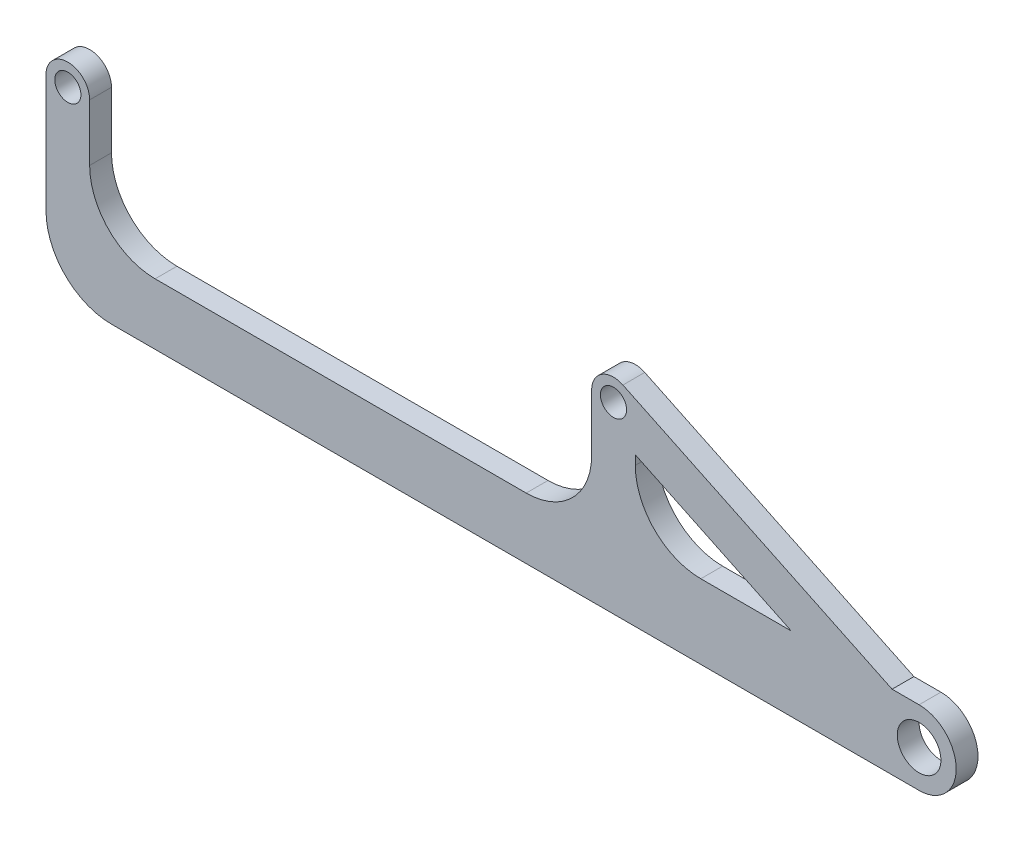
ISO-10303-21;
HEADER;
FILE_DESCRIPTION(('STEP AP214'),'2;1');
FILE_NAME('part.step','',(''),(''),'','','');
FILE_SCHEMA(('AUTOMOTIVE_DESIGN { 1 0 10303 214 1 1 1 1 }'));
ENDSEC;
DATA;
#1=APPLICATION_CONTEXT('core data for automotive mechanical design processes');
#2=APPLICATION_PROTOCOL_DEFINITION('international standard','automotive_design',2000,#1);
#3=PRODUCT_CONTEXT('',#1,'mechanical');
#4=PRODUCT('Part','Part','',(#3));
#5=PRODUCT_RELATED_PRODUCT_CATEGORY('part','',(#4));
#6=PRODUCT_DEFINITION_FORMATION('','',#4);
#7=PRODUCT_DEFINITION_CONTEXT('part definition',#1,'design');
#8=PRODUCT_DEFINITION('design','',#6,#7);
#9=PRODUCT_DEFINITION_SHAPE('','',#8);
#10=(LENGTH_UNIT() NAMED_UNIT(*) SI_UNIT(.MILLI.,.METRE.));
#11=(NAMED_UNIT(*) PLANE_ANGLE_UNIT() SI_UNIT($,.RADIAN.));
#12=(NAMED_UNIT(*) SI_UNIT($,.STERADIAN.) SOLID_ANGLE_UNIT());
#13=UNCERTAINTY_MEASURE_WITH_UNIT(LENGTH_MEASURE(1.E-05),#10,'distance_accuracy_value','');
#14=(GEOMETRIC_REPRESENTATION_CONTEXT(3) GLOBAL_UNCERTAINTY_ASSIGNED_CONTEXT((#13)) GLOBAL_UNIT_ASSIGNED_CONTEXT((#10,
#11,#12)) REPRESENTATION_CONTEXT('',''));
#15=CARTESIAN_POINT('',(0.,0.,0.));
#16=DIRECTION('',(0.,0.,1.));
#17=DIRECTION('',(1.,0.,0.));
#18=AXIS2_PLACEMENT_3D('',#15,#16,#17);
#19=CARTESIAN_POINT('',(184.164810690423,-64.4576837416478,5.));
#20=DIRECTION('',(-0.943858356366018,0.330350424728104,0.));
#21=DIRECTION('',(-0.330350424728104,-0.943858356366018,0.));
#22=AXIS2_PLACEMENT_3D('',#19,#20,#21);
#23=PLANE('',#22);
#24=DIRECTION('',(0.330350424728104,0.943858356366018,0.));
#25=VECTOR('',#24,1.);
#26=CARTESIAN_POINT('',(184.164810690423,-64.4576837416478,0.));
#27=LINE('',#26,#25);
#28=CARTESIAN_POINT('',(196.651752123637,-28.78070821818,0.));
#29=VERTEX_POINT('',#28);
#30=CARTESIAN_POINT('',(196.661737840516,-28.7521775985262,0.));
#31=VERTEX_POINT('',#30);
#32=EDGE_CURVE('E200',#29,#31,#27,.T.);
#33=ORIENTED_EDGE('',*,*,#32,.T.);
#34=DIRECTION('',(0.,0.,-1.));
#35=VECTOR('',#34,1.);
#36=CARTESIAN_POINT('',(196.661737840516,-28.7521775985262,5.));
#37=LINE('',#36,#35);
#38=CARTESIAN_POINT('',(196.661737840516,-28.7521775985262,5.));
#39=VERTEX_POINT('',#38);
#40=EDGE_CURVE('E11',#39,#31,#37,.T.);
#41=ORIENTED_EDGE('',*,*,#40,.F.);
#42=DIRECTION('',(0.330350424728104,0.943858356366018,0.));
#43=VECTOR('',#42,1.);
#44=CARTESIAN_POINT('',(184.164810690423,-64.4576837416478,5.));
#45=LINE('',#44,#43);
#46=CARTESIAN_POINT('',(196.651752123637,-28.78070821818,5.));
#47=VERTEX_POINT('',#46);
#48=EDGE_CURVE('E193',#47,#39,#45,.T.);
#49=ORIENTED_EDGE('',*,*,#48,.F.);
#50=DIRECTION('',(0.,0.,-1.));
#51=VECTOR('',#50,1.);
#52=CARTESIAN_POINT('',(196.651752123637,-28.78070821818,5.));
#53=LINE('',#52,#51);
#54=EDGE_CURVE('E61',#47,#29,#53,.T.);
#55=ORIENTED_EDGE('',*,*,#54,.T.);
#56=EDGE_LOOP('',(#33,#41,#49,#55));
#57=FACE_BOUND('',#56,.T.);
#58=ADVANCED_FACE('F41',(#57),#23,.F.);
#59=CARTESIAN_POINT('',(25.4522443975422,53.1837942635002,5.));
#60=DIRECTION('',(0.431683467906827,0.902025156819884,0.));
#61=DIRECTION('',(-0.902025156819884,0.431683467906827,0.));
#62=AXIS2_PLACEMENT_3D('',#59,#60,#61);
#63=PLANE('',#62);
#64=DIRECTION('',(0.902025156819884,-0.431683467906827,0.));
#65=VECTOR('',#64,1.);
#66=CARTESIAN_POINT('',(25.4522443975422,53.1837942635002,0.));
#67=LINE('',#66,#65);
#68=CARTESIAN_POINT('',(197.15841733952,-28.9898742159071,0.));
#69=VERTEX_POINT('',#68);
#70=EDGE_CURVE('E204',#31,#69,#67,.T.);
#71=ORIENTED_EDGE('',*,*,#70,.T.);
#72=DIRECTION('',(0.,0.,-1.));
#73=VECTOR('',#72,1.);
#74=CARTESIAN_POINT('',(197.15841733952,-28.9898742159071,5.));
#75=LINE('',#74,#73);
#76=CARTESIAN_POINT('',(197.15841733952,-28.9898742159071,5.));
#77=VERTEX_POINT('',#76);
#78=EDGE_CURVE('E52',#77,#69,#75,.T.);
#79=ORIENTED_EDGE('',*,*,#78,.F.);
#80=DIRECTION('',(0.902025156819884,-0.431683467906827,0.));
#81=VECTOR('',#80,1.);
#82=CARTESIAN_POINT('',(25.4522443975422,53.1837942635002,5.));
#83=LINE('',#82,#81);
#84=EDGE_CURVE('E185',#39,#77,#83,.T.);
#85=ORIENTED_EDGE('',*,*,#84,.F.);
#86=ORIENTED_EDGE('',*,*,#40,.T.);
#87=EDGE_LOOP('',(#71,#79,#85,#86));
#88=FACE_BOUND('',#87,.T.);
#89=ADVANCED_FACE('F187',(#88),#63,.F.);
#90=CARTESIAN_POINT('',(21.1483800823384,44.1906449481698,5.));
#91=DIRECTION('',(-0.43168346790669,-0.902025156819949,0.));
#92=DIRECTION('',(0.902025156819949,-0.43168346790669,0.));
#93=AXIS2_PLACEMENT_3D('',#90,#91,#92);
#94=PLANE('',#93);
#95=DIRECTION('',(-0.902025156819949,0.43168346790669,0.));
#96=VECTOR('',#95,1.);
#97=CARTESIAN_POINT('',(21.1483800823384,44.1906449481698,0.));
#98=LINE('',#97,#96);
#99=CARTESIAN_POINT('',(165.725847138216,-25.,0.));
#100=VERTEX_POINT('',#99);
#101=CARTESIAN_POINT('',(130.,-7.90263029813969,0.));
#102=VERTEX_POINT('',#101);
#103=EDGE_CURVE('E347',#100,#102,#98,.T.);
#104=ORIENTED_EDGE('',*,*,#103,.F.);
#105=DIRECTION('',(0.,0.,-1.));
#106=VECTOR('',#105,1.);
#107=CARTESIAN_POINT('',(165.725847138216,-25.,5.));
#108=LINE('',#107,#106);
#109=CARTESIAN_POINT('',(165.725847138216,-25.,5.));
#110=VERTEX_POINT('',#109);
#111=EDGE_CURVE('E229',#110,#100,#108,.T.);
#112=ORIENTED_EDGE('',*,*,#111,.F.);
#113=DIRECTION('',(-0.902025156819949,0.43168346790669,0.));
#114=VECTOR('',#113,1.);
#115=CARTESIAN_POINT('',(21.1483800823384,44.1906449481698,5.));
#116=LINE('',#115,#114);
#117=CARTESIAN_POINT('',(130.,-7.90263029813969,5.));
#118=VERTEX_POINT('',#117);
#119=EDGE_CURVE('E845',#110,#118,#116,.T.);
#120=ORIENTED_EDGE('',*,*,#119,.T.);
#121=DIRECTION('',(0.,0.,-1.));
#122=VECTOR('',#121,1.);
#123=CARTESIAN_POINT('',(130.,-7.90263029813969,5.));
#124=LINE('',#123,#122);
#125=EDGE_CURVE('E232',#118,#102,#124,.T.);
#126=ORIENTED_EDGE('',*,*,#125,.T.);
#127=EDGE_LOOP('',(#104,#112,#120,#126));
#128=FACE_BOUND('',#127,.T.);
#129=ADVANCED_FACE('F373',(#128),#94,.T.);
#130=CARTESIAN_POINT('',(0.,-25.,5.));
#131=DIRECTION('',(0.,1.,0.));
#132=DIRECTION('',(0.,0.,1.));
#133=AXIS2_PLACEMENT_3D('',#130,#131,#132);
#134=PLANE('',#133);
#135=DIRECTION('',(1.,0.,0.));
#136=VECTOR('',#135,1.);
#137=CARTESIAN_POINT('',(0.,-25.,0.));
#138=LINE('',#137,#136);
#139=CARTESIAN_POINT('',(145.,-25.,0.));
#140=VERTEX_POINT('',#139);
#141=EDGE_CURVE('E351',#140,#100,#138,.T.);
#142=ORIENTED_EDGE('',*,*,#141,.F.);
#143=DIRECTION('',(0.,0.,-1.));
#144=VECTOR('',#143,1.);
#145=CARTESIAN_POINT('',(145.,-25.,5.));
#146=LINE('',#145,#144);
#147=CARTESIAN_POINT('',(145.,-25.,5.));
#148=VERTEX_POINT('',#147);
#149=EDGE_CURVE('E238',#148,#140,#146,.T.);
#150=ORIENTED_EDGE('',*,*,#149,.F.);
#151=DIRECTION('',(1.,0.,0.));
#152=VECTOR('',#151,1.);
#153=CARTESIAN_POINT('',(0.,-25.,5.));
#154=LINE('',#153,#152);
#155=EDGE_CURVE('E369',#148,#110,#154,.T.);
#156=ORIENTED_EDGE('',*,*,#155,.T.);
#157=ORIENTED_EDGE('',*,*,#111,.T.);
#158=EDGE_LOOP('',(#142,#150,#156,#157));
#159=FACE_BOUND('',#158,.T.);
#160=ADVANCED_FACE('F367',(#159),#134,.T.);
#161=CARTESIAN_POINT('',(145.,-9.99999999999998,5.));
#162=DIRECTION('',(0.,0.,-1.));
#163=DIRECTION('',(-1.,0.,0.));
#164=AXIS2_PLACEMENT_3D('',#161,#162,#163);
#165=CYLINDRICAL_SURFACE('',#164,15.);
#166=CARTESIAN_POINT('',(145.,-9.99999999999998,0.));
#167=DIRECTION('',(0.,0.,1.));
#168=DIRECTION('',(1.,0.,0.));
#169=AXIS2_PLACEMENT_3D('',#166,#167,#168);
#170=CIRCLE('',#169,15.);
#171=CARTESIAN_POINT('',(130.,-9.99999999999998,0.));
#172=VERTEX_POINT('',#171);
#173=EDGE_CURVE('E212',#172,#140,#170,.T.);
#174=ORIENTED_EDGE('',*,*,#173,.F.);
#175=DIRECTION('',(0.,0.,-1.));
#176=VECTOR('',#175,1.);
#177=CARTESIAN_POINT('',(130.,-9.99999999999998,5.));
#178=LINE('',#177,#176);
#179=CARTESIAN_POINT('',(130.,-9.99999999999998,5.));
#180=VERTEX_POINT('',#179);
#181=EDGE_CURVE('E235',#180,#172,#178,.T.);
#182=ORIENTED_EDGE('',*,*,#181,.F.);
#183=CARTESIAN_POINT('',(145.,-9.99999999999998,5.));
#184=DIRECTION('',(0.,0.,1.));
#185=DIRECTION('',(1.,0.,0.));
#186=AXIS2_PLACEMENT_3D('',#183,#184,#185);
#187=CIRCLE('',#186,15.);
#188=EDGE_CURVE('E363',#180,#148,#187,.T.);
#189=ORIENTED_EDGE('',*,*,#188,.T.);
#190=ORIENTED_EDGE('',*,*,#149,.T.);
#191=EDGE_LOOP('',(#174,#182,#189,#190));
#192=FACE_BOUND('',#191,.T.);
#193=ADVANCED_FACE('F360',(#192),#165,.F.);
#194=CARTESIAN_POINT('',(0.,-25.,5.));
#195=DIRECTION('',(0.,1.,0.));
#196=DIRECTION('',(0.,0.,1.));
#197=AXIS2_PLACEMENT_3D('',#194,#195,#196);
#198=PLANE('',#197);
#199=DIRECTION('',(1.,0.,0.));
#200=VECTOR('',#199,1.);
#201=CARTESIAN_POINT('',(0.,-25.,0.));
#202=LINE('',#201,#200);
#203=CARTESIAN_POINT('',(188.821366739121,-25.,0.));
#204=VERTEX_POINT('',#203);
#205=CARTESIAN_POINT('',(195.,-25.,0.));
#206=VERTEX_POINT('',#205);
#207=EDGE_CURVE('E293',#204,#206,#202,.T.);
#208=ORIENTED_EDGE('',*,*,#207,.F.);
#209=DIRECTION('',(0.,0.,-1.));
#210=VECTOR('',#209,1.);
#211=CARTESIAN_POINT('',(188.821366739121,-25.,5.));
#212=LINE('',#211,#210);
#213=CARTESIAN_POINT('',(188.821366739121,-25.,5.));
#214=VERTEX_POINT('',#213);
#215=EDGE_CURVE('E45',#214,#204,#212,.T.);
#216=ORIENTED_EDGE('',*,*,#215,.F.);
#217=DIRECTION('',(1.,0.,0.));
#218=VECTOR('',#217,1.);
#219=CARTESIAN_POINT('',(0.,-25.,5.));
#220=LINE('',#219,#218);
#221=CARTESIAN_POINT('',(195.,-25.,5.));
#222=VERTEX_POINT('',#221);
#223=EDGE_CURVE('E226',#214,#222,#220,.T.);
#224=ORIENTED_EDGE('',*,*,#223,.T.);
#225=DIRECTION('',(0.,0.,-1.));
#226=VECTOR('',#225,1.);
#227=CARTESIAN_POINT('',(195.,-25.,5.));
#228=LINE('',#227,#226);
#229=EDGE_CURVE('E243',#222,#206,#228,.T.);
#230=ORIENTED_EDGE('',*,*,#229,.T.);
#231=EDGE_LOOP('',(#208,#216,#224,#230));
#232=FACE_BOUND('',#231,.T.);
#233=ADVANCED_FACE('F43',(#232),#198,.T.);
#234=CARTESIAN_POINT('',(25.4522443975422,53.1837942635002,5.));
#235=DIRECTION('',(0.431683467906827,0.902025156819884,0.));
#236=DIRECTION('',(-0.902025156819884,0.431683467906827,0.));
#237=AXIS2_PLACEMENT_3D('',#234,#235,#236);
#238=PLANE('',#237);
#239=DIRECTION('',(0.902025156819884,-0.431683467906827,0.));
#240=VECTOR('',#239,1.);
#241=CARTESIAN_POINT('',(25.4522443975422,53.1837942635002,0.));
#242=LINE('',#241,#240);
#243=CARTESIAN_POINT('',(127.158417339533,4.51012578409975,0.));
#244=VERTEX_POINT('',#243);
#245=EDGE_CURVE('E288',#244,#204,#242,.T.);
#246=ORIENTED_EDGE('',*,*,#245,.F.);
#247=DIRECTION('',(0.,0.,-1.));
#248=VECTOR('',#247,1.);
#249=CARTESIAN_POINT('',(127.158417339533,4.51012578409975,5.));
#250=LINE('',#249,#248);
#251=CARTESIAN_POINT('',(127.158417339533,4.51012578409975,5.));
#252=VERTEX_POINT('',#251);
#253=EDGE_CURVE('E277',#252,#244,#250,.T.);
#254=ORIENTED_EDGE('',*,*,#253,.F.);
#255=DIRECTION('',(0.902025156819884,-0.431683467906827,0.));
#256=VECTOR('',#255,1.);
#257=CARTESIAN_POINT('',(25.4522443975422,53.1837942635002,5.));
#258=LINE('',#257,#256);
#259=EDGE_CURVE('E291',#252,#214,#258,.T.);
#260=ORIENTED_EDGE('',*,*,#259,.T.);
#261=ORIENTED_EDGE('',*,*,#215,.T.);
#262=EDGE_LOOP('',(#246,#254,#260,#261));
#263=FACE_BOUND('',#262,.T.);
#264=ADVANCED_FACE('F286',(#263),#238,.T.);
#265=CARTESIAN_POINT('',(125.,0.,5.));
#266=DIRECTION('',(0.,0.,-1.));
#267=DIRECTION('',(-1.,0.,0.));
#268=AXIS2_PLACEMENT_3D('',#265,#266,#267);
#269=CYLINDRICAL_SURFACE('',#268,5.);
#270=CARTESIAN_POINT('',(125.,0.,0.));
#271=DIRECTION('',(0.,0.,1.));
#272=DIRECTION('',(1.,0.,0.));
#273=AXIS2_PLACEMENT_3D('',#270,#271,#272);
#274=CIRCLE('',#273,5.);
#275=CARTESIAN_POINT('',(120.,0.,0.));
#276=VERTEX_POINT('',#275);
#277=EDGE_CURVE('E302',#276,#244,#274,.F.);
#278=ORIENTED_EDGE('',*,*,#277,.F.);
#279=DIRECTION('',(0.,0.,-1.));
#280=VECTOR('',#279,1.);
#281=CARTESIAN_POINT('',(120.,0.,5.));
#282=LINE('',#281,#280);
#283=CARTESIAN_POINT('',(120.,0.,5.));
#284=VERTEX_POINT('',#283);
#285=EDGE_CURVE('E275',#284,#276,#282,.T.);
#286=ORIENTED_EDGE('',*,*,#285,.F.);
#287=CARTESIAN_POINT('',(125.,0.,5.));
#288=DIRECTION('',(0.,0.,1.));
#289=DIRECTION('',(1.,0.,0.));
#290=AXIS2_PLACEMENT_3D('',#287,#288,#289);
#291=CIRCLE('',#290,5.);
#292=EDGE_CURVE('E800',#284,#252,#291,.F.);
#293=ORIENTED_EDGE('',*,*,#292,.T.);
#294=ORIENTED_EDGE('',*,*,#253,.T.);
#295=EDGE_LOOP('',(#278,#286,#293,#294));
#296=FACE_BOUND('',#295,.T.);
#297=ADVANCED_FACE('F463',(#296),#269,.T.);
#298=CARTESIAN_POINT('',(120.,0.,5.));
#299=DIRECTION('',(1.,0.,0.));
#300=DIRECTION('',(0.,0.,-1.));
#301=AXIS2_PLACEMENT_3D('',#298,#299,#300);
#302=PLANE('',#301);
#303=DIRECTION('',(0.,-1.,0.));
#304=VECTOR('',#303,1.);
#305=CARTESIAN_POINT('',(120.,0.,0.));
#306=LINE('',#305,#304);
#307=CARTESIAN_POINT('',(120.,-13.,0.));
#308=VERTEX_POINT('',#307);
#309=EDGE_CURVE('E306',#276,#308,#306,.T.);
#310=ORIENTED_EDGE('',*,*,#309,.T.);
#311=DIRECTION('',(0.,0.,-1.));
#312=VECTOR('',#311,1.);
#313=CARTESIAN_POINT('',(120.,-13.,5.));
#314=LINE('',#313,#312);
#315=CARTESIAN_POINT('',(120.,-13.,5.));
#316=VERTEX_POINT('',#315);
#317=EDGE_CURVE('E272',#316,#308,#314,.T.);
#318=ORIENTED_EDGE('',*,*,#317,.F.);
#319=DIRECTION('',(0.,-1.,0.));
#320=VECTOR('',#319,1.);
#321=CARTESIAN_POINT('',(120.,0.,5.));
#322=LINE('',#321,#320);
#323=EDGE_CURVE('E802',#284,#316,#322,.T.);
#324=ORIENTED_EDGE('',*,*,#323,.F.);
#325=ORIENTED_EDGE('',*,*,#285,.T.);
#326=EDGE_LOOP('',(#310,#318,#324,#325));
#327=FACE_BOUND('',#326,.T.);
#328=ADVANCED_FACE('F459',(#327),#302,.F.);
#329=CARTESIAN_POINT('',(105.,-13.,5.));
#330=DIRECTION('',(0.,0.,-1.));
#331=DIRECTION('',(-1.,0.,0.));
#332=AXIS2_PLACEMENT_3D('',#329,#330,#331);
#333=CYLINDRICAL_SURFACE('',#332,15.);
#334=CARTESIAN_POINT('',(105.,-13.,0.));
#335=DIRECTION('',(0.,0.,1.));
#336=DIRECTION('',(1.,0.,0.));
#337=AXIS2_PLACEMENT_3D('',#334,#335,#336);
#338=CIRCLE('',#337,15.);
#339=CARTESIAN_POINT('',(105.,-28.,0.));
#340=VERTEX_POINT('',#339);
#341=EDGE_CURVE('E313',#340,#308,#338,.T.);
#342=ORIENTED_EDGE('',*,*,#341,.F.);
#343=DIRECTION('',(0.,0.,-1.));
#344=VECTOR('',#343,1.);
#345=CARTESIAN_POINT('',(105.,-28.,5.));
#346=LINE('',#345,#344);
#347=CARTESIAN_POINT('',(105.,-28.,5.));
#348=VERTEX_POINT('',#347);
#349=EDGE_CURVE('E269',#348,#340,#346,.T.);
#350=ORIENTED_EDGE('',*,*,#349,.F.);
#351=CARTESIAN_POINT('',(105.,-13.,5.));
#352=DIRECTION('',(0.,0.,1.));
#353=DIRECTION('',(1.,0.,0.));
#354=AXIS2_PLACEMENT_3D('',#351,#352,#353);
#355=CIRCLE('',#354,15.);
#356=EDGE_CURVE('E806',#348,#316,#355,.T.);
#357=ORIENTED_EDGE('',*,*,#356,.T.);
#358=ORIENTED_EDGE('',*,*,#317,.T.);
#359=EDGE_LOOP('',(#342,#350,#357,#358));
#360=FACE_BOUND('',#359,.T.);
#361=ADVANCED_FACE('F455',(#360),#333,.F.);
#362=CARTESIAN_POINT('',(0.,-28.,5.));
#363=DIRECTION('',(0.,-1.,0.));
#364=DIRECTION('',(1.,0.,0.));
#365=AXIS2_PLACEMENT_3D('',#362,#363,#364);
#366=PLANE('',#365);
#367=DIRECTION('',(-1.,0.,0.));
#368=VECTOR('',#367,1.);
#369=CARTESIAN_POINT('',(0.,-28.,0.));
#370=LINE('',#369,#368);
#371=CARTESIAN_POINT('',(20.,-28.,0.));
#372=VERTEX_POINT('',#371);
#373=EDGE_CURVE('E317',#340,#372,#370,.T.);
#374=ORIENTED_EDGE('',*,*,#373,.T.);
#375=DIRECTION('',(0.,0.,-1.));
#376=VECTOR('',#375,1.);
#377=CARTESIAN_POINT('',(20.,-28.,5.));
#378=LINE('',#377,#376);
#379=CARTESIAN_POINT('',(20.,-28.,5.));
#380=VERTEX_POINT('',#379);
#381=EDGE_CURVE('E266',#380,#372,#378,.T.);
#382=ORIENTED_EDGE('',*,*,#381,.F.);
#383=DIRECTION('',(-1.,0.,0.));
#384=VECTOR('',#383,1.);
#385=CARTESIAN_POINT('',(0.,-28.,5.));
#386=LINE('',#385,#384);
#387=EDGE_CURVE('E816',#348,#380,#386,.T.);
#388=ORIENTED_EDGE('',*,*,#387,.F.);
#389=ORIENTED_EDGE('',*,*,#349,.T.);
#390=EDGE_LOOP('',(#374,#382,#388,#389));
#391=FACE_BOUND('',#390,.T.);
#392=ADVANCED_FACE('F451',(#391),#366,.F.);
#393=CARTESIAN_POINT('',(20.,-13.,5.));
#394=DIRECTION('',(0.,0.,-1.));
#395=DIRECTION('',(-1.,0.,0.));
#396=AXIS2_PLACEMENT_3D('',#393,#394,#395);
#397=CYLINDRICAL_SURFACE('',#396,15.);
#398=CARTESIAN_POINT('',(20.,-13.,0.));
#399=DIRECTION('',(0.,0.,1.));
#400=DIRECTION('',(1.,0.,0.));
#401=AXIS2_PLACEMENT_3D('',#398,#399,#400);
#402=CIRCLE('',#401,15.);
#403=CARTESIAN_POINT('',(5.,-13.,0.));
#404=VERTEX_POINT('',#403);
#405=EDGE_CURVE('E321',#404,#372,#402,.T.);
#406=ORIENTED_EDGE('',*,*,#405,.F.);
#407=DIRECTION('',(0.,0.,-1.));
#408=VECTOR('',#407,1.);
#409=CARTESIAN_POINT('',(5.,-13.,5.));
#410=LINE('',#409,#408);
#411=CARTESIAN_POINT('',(5.,-13.,5.));
#412=VERTEX_POINT('',#411);
#413=EDGE_CURVE('E263',#412,#404,#410,.T.);
#414=ORIENTED_EDGE('',*,*,#413,.F.);
#415=CARTESIAN_POINT('',(20.,-13.,5.));
#416=DIRECTION('',(0.,0.,1.));
#417=DIRECTION('',(1.,0.,0.));
#418=AXIS2_PLACEMENT_3D('',#415,#416,#417);
#419=CIRCLE('',#418,15.);
#420=EDGE_CURVE('E819',#412,#380,#419,.T.);
#421=ORIENTED_EDGE('',*,*,#420,.T.);
#422=ORIENTED_EDGE('',*,*,#381,.T.);
#423=EDGE_LOOP('',(#406,#414,#421,#422));
#424=FACE_BOUND('',#423,.T.);
#425=ADVANCED_FACE('F447',(#424),#397,.F.);
#426=CARTESIAN_POINT('',(5.,0.,5.));
#427=DIRECTION('',(1.,0.,0.));
#428=DIRECTION('',(0.,1.,0.));
#429=AXIS2_PLACEMENT_3D('',#426,#427,#428);
#430=PLANE('',#429);
#431=DIRECTION('',(0.,-1.,0.));
#432=VECTOR('',#431,1.);
#433=CARTESIAN_POINT('',(5.,0.,0.));
#434=LINE('',#433,#432);
#435=CARTESIAN_POINT('',(5.,0.,0.));
#436=VERTEX_POINT('',#435);
#437=EDGE_CURVE('E325',#436,#404,#434,.T.);
#438=ORIENTED_EDGE('',*,*,#437,.F.);
#439=DIRECTION('',(0.,0.,-1.));
#440=VECTOR('',#439,1.);
#441=CARTESIAN_POINT('',(5.,0.,5.));
#442=LINE('',#441,#440);
#443=CARTESIAN_POINT('',(5.,0.,5.));
#444=VERTEX_POINT('',#443);
#445=EDGE_CURVE('E260',#444,#436,#442,.T.);
#446=ORIENTED_EDGE('',*,*,#445,.F.);
#447=DIRECTION('',(0.,-1.,0.));
#448=VECTOR('',#447,1.);
#449=CARTESIAN_POINT('',(5.,0.,5.));
#450=LINE('',#449,#448);
#451=EDGE_CURVE('E823',#444,#412,#450,.T.);
#452=ORIENTED_EDGE('',*,*,#451,.T.);
#453=ORIENTED_EDGE('',*,*,#413,.T.);
#454=EDGE_LOOP('',(#438,#446,#452,#453));
#455=FACE_BOUND('',#454,.T.);
#456=ADVANCED_FACE('F443',(#455),#430,.T.);
#457=CARTESIAN_POINT('',(0.,0.,5.));
#458=DIRECTION('',(0.,0.,-1.));
#459=DIRECTION('',(-1.,0.,0.));
#460=AXIS2_PLACEMENT_3D('',#457,#458,#459);
#461=CYLINDRICAL_SURFACE('',#460,5.);
#462=CARTESIAN_POINT('',(0.,0.,0.));
#463=DIRECTION('',(0.,0.,1.));
#464=DIRECTION('',(1.,0.,0.));
#465=AXIS2_PLACEMENT_3D('',#462,#463,#464);
#466=CIRCLE('',#465,5.);
#467=CARTESIAN_POINT('',(-5.,0.,0.));
#468=VERTEX_POINT('',#467);
#469=EDGE_CURVE('E329',#468,#436,#466,.F.);
#470=ORIENTED_EDGE('',*,*,#469,.F.);
#471=DIRECTION('',(0.,0.,-1.));
#472=VECTOR('',#471,1.);
#473=CARTESIAN_POINT('',(-5.,0.,5.));
#474=LINE('',#473,#472);
#475=CARTESIAN_POINT('',(-5.,0.,5.));
#476=VERTEX_POINT('',#475);
#477=EDGE_CURVE('E257',#476,#468,#474,.T.);
#478=ORIENTED_EDGE('',*,*,#477,.F.);
#479=CARTESIAN_POINT('',(0.,0.,5.));
#480=DIRECTION('',(0.,0.,1.));
#481=DIRECTION('',(1.,0.,0.));
#482=AXIS2_PLACEMENT_3D('',#479,#480,#481);
#483=CIRCLE('',#482,5.);
#484=EDGE_CURVE('E827',#476,#444,#483,.F.);
#485=ORIENTED_EDGE('',*,*,#484,.T.);
#486=ORIENTED_EDGE('',*,*,#445,.T.);
#487=EDGE_LOOP('',(#470,#478,#485,#486));
#488=FACE_BOUND('',#487,.T.);
#489=ADVANCED_FACE('F439',(#488),#461,.T.);
#490=CARTESIAN_POINT('',(-5.,0.,5.));
#491=DIRECTION('',(1.,0.,0.));
#492=DIRECTION('',(0.,1.,0.));
#493=AXIS2_PLACEMENT_3D('',#490,#491,#492);
#494=PLANE('',#493);
#495=DIRECTION('',(0.,-1.,0.));
#496=VECTOR('',#495,1.);
#497=CARTESIAN_POINT('',(-5.,0.,0.));
#498=LINE('',#497,#496);
#499=CARTESIAN_POINT('',(-5.,-27.,0.));
#500=VERTEX_POINT('',#499);
#501=EDGE_CURVE('E333',#468,#500,#498,.T.);
#502=ORIENTED_EDGE('',*,*,#501,.T.);
#503=DIRECTION('',(0.,0.,-1.));
#504=VECTOR('',#503,1.);
#505=CARTESIAN_POINT('',(-5.,-27.,5.));
#506=LINE('',#505,#504);
#507=CARTESIAN_POINT('',(-5.,-27.,5.));
#508=VERTEX_POINT('',#507);
#509=EDGE_CURVE('E253',#508,#500,#506,.T.);
#510=ORIENTED_EDGE('',*,*,#509,.F.);
#511=DIRECTION('',(0.,-1.,0.));
#512=VECTOR('',#511,1.);
#513=CARTESIAN_POINT('',(-5.,0.,5.));
#514=LINE('',#513,#512);
#515=EDGE_CURVE('E831',#476,#508,#514,.T.);
#516=ORIENTED_EDGE('',*,*,#515,.F.);
#517=ORIENTED_EDGE('',*,*,#477,.T.);
#518=EDGE_LOOP('',(#502,#510,#516,#517));
#519=FACE_BOUND('',#518,.T.);
#520=ADVANCED_FACE('F435',(#519),#494,.F.);
#521=CARTESIAN_POINT('',(10.,-27.,5.));
#522=DIRECTION('',(0.,0.,-1.));
#523=DIRECTION('',(-1.,0.,0.));
#524=AXIS2_PLACEMENT_3D('',#521,#522,#523);
#525=CYLINDRICAL_SURFACE('',#524,15.);
#526=CARTESIAN_POINT('',(10.,-27.,0.));
#527=DIRECTION('',(0.,0.,1.));
#528=DIRECTION('',(1.,0.,0.));
#529=AXIS2_PLACEMENT_3D('',#526,#527,#528);
#530=CIRCLE('',#529,15.);
#531=CARTESIAN_POINT('',(10.,-42.,0.));
#532=VERTEX_POINT('',#531);
#533=EDGE_CURVE('E336',#500,#532,#530,.T.);
#534=ORIENTED_EDGE('',*,*,#533,.T.);
#535=DIRECTION('',(0.,0.,-1.));
#536=VECTOR('',#535,1.);
#537=CARTESIAN_POINT('',(10.,-42.,5.));
#538=LINE('',#537,#536);
#539=CARTESIAN_POINT('',(10.,-42.,5.));
#540=VERTEX_POINT('',#539);
#541=EDGE_CURVE('E250',#540,#532,#538,.T.);
#542=ORIENTED_EDGE('',*,*,#541,.F.);
#543=CARTESIAN_POINT('',(10.,-27.,5.));
#544=DIRECTION('',(0.,0.,1.));
#545=DIRECTION('',(1.,0.,0.));
#546=AXIS2_PLACEMENT_3D('',#543,#544,#545);
#547=CIRCLE('',#546,15.);
#548=EDGE_CURVE('E834',#508,#540,#547,.T.);
#549=ORIENTED_EDGE('',*,*,#548,.F.);
#550=ORIENTED_EDGE('',*,*,#509,.T.);
#551=EDGE_LOOP('',(#534,#542,#549,#550));
#552=FACE_BOUND('',#551,.T.);
#553=ADVANCED_FACE('F431',(#552),#525,.T.);
#554=CARTESIAN_POINT('',(0.,-42.,5.));
#555=DIRECTION('',(0.,-1.,0.));
#556=DIRECTION('',(1.,0.,0.));
#557=AXIS2_PLACEMENT_3D('',#554,#555,#556);
#558=PLANE('',#557);
#559=DIRECTION('',(-1.,0.,0.));
#560=VECTOR('',#559,1.);
#561=CARTESIAN_POINT('',(0.,-42.,0.));
#562=LINE('',#561,#560);
#563=CARTESIAN_POINT('',(195.,-42.,0.));
#564=VERTEX_POINT('',#563);
#565=EDGE_CURVE('E340',#564,#532,#562,.T.);
#566=ORIENTED_EDGE('',*,*,#565,.F.);
#567=DIRECTION('',(0.,0.,-1.));
#568=VECTOR('',#567,1.);
#569=CARTESIAN_POINT('',(195.,-42.,5.));
#570=LINE('',#569,#568);
#571=CARTESIAN_POINT('',(195.,-42.,5.));
#572=VERTEX_POINT('',#571);
#573=EDGE_CURVE('E246',#572,#564,#570,.T.);
#574=ORIENTED_EDGE('',*,*,#573,.F.);
#575=DIRECTION('',(-1.,0.,0.));
#576=VECTOR('',#575,1.);
#577=CARTESIAN_POINT('',(0.,-42.,5.));
#578=LINE('',#577,#576);
#579=EDGE_CURVE('E837',#572,#540,#578,.T.);
#580=ORIENTED_EDGE('',*,*,#579,.T.);
#581=ORIENTED_EDGE('',*,*,#541,.T.);
#582=EDGE_LOOP('',(#566,#574,#580,#581));
#583=FACE_BOUND('',#582,.T.);
#584=ADVANCED_FACE('F427',(#583),#558,.T.);
#585=CARTESIAN_POINT('',(125.,0.,5.));
#586=DIRECTION('',(0.,0.,-1.));
#587=DIRECTION('',(-1.,0.,0.));
#588=AXIS2_PLACEMENT_3D('',#585,#586,#587);
#589=CYLINDRICAL_SURFACE('',#588,2.99999999999999);
#590=CARTESIAN_POINT('',(125.,0.,5.));
#591=DIRECTION('',(0.,0.,1.));
#592=DIRECTION('',(1.,0.,0.));
#593=AXIS2_PLACEMENT_3D('',#590,#591,#592);
#594=CIRCLE('',#593,2.99999999999999);
#595=CARTESIAN_POINT('',(128.,0.,5.));
#596=VERTEX_POINT('',#595);
#597=EDGE_CURVE('E387',#596,#596,#594,.T.);
#598=ORIENTED_EDGE('',*,*,#597,.T.);
#599=EDGE_LOOP('',(#598));
#600=FACE_BOUND('',#599,.T.);
#601=CARTESIAN_POINT('',(125.,0.,0.));
#602=DIRECTION('',(0.,0.,1.));
#603=DIRECTION('',(1.,0.,0.));
#604=AXIS2_PLACEMENT_3D('',#601,#602,#603);
#605=CIRCLE('',#604,2.99999999999999);
#606=CARTESIAN_POINT('',(128.,0.,0.));
#607=VERTEX_POINT('',#606);
#608=EDGE_CURVE('E218',#607,#607,#605,.T.);
#609=ORIENTED_EDGE('',*,*,#608,.F.);
#610=EDGE_LOOP('',(#609));
#611=FACE_BOUND('',#610,.T.);
#612=ADVANCED_FACE('F430',(#600,#611),#589,.F.);
#613=CARTESIAN_POINT('',(194.999999999989,-33.5,5.));
#614=DIRECTION('',(0.,0.,-1.));
#615=DIRECTION('',(-1.,0.,0.));
#616=AXIS2_PLACEMENT_3D('',#613,#614,#615);
#617=CYLINDRICAL_SURFACE('',#616,4.99999999999282);
#618=CARTESIAN_POINT('',(194.999999999989,-33.5,0.));
#619=DIRECTION('',(0.,0.,1.));
#620=DIRECTION('',(1.,0.,0.));
#621=AXIS2_PLACEMENT_3D('',#618,#619,#620);
#622=CIRCLE('',#621,4.99999999999282);
#623=EDGE_CURVE('E209',#29,#69,#622,.T.);
#624=ORIENTED_EDGE('',*,*,#623,.F.);
#625=ORIENTED_EDGE('',*,*,#54,.F.);
#626=CARTESIAN_POINT('',(194.999999999989,-33.5,5.));
#627=DIRECTION('',(0.,0.,1.));
#628=DIRECTION('',(1.,0.,0.));
#629=AXIS2_PLACEMENT_3D('',#626,#627,#628);
#630=CIRCLE('',#629,4.99999999999282);
#631=EDGE_CURVE('E192',#47,#77,#630,.T.);
#632=ORIENTED_EDGE('',*,*,#631,.T.);
#633=ORIENTED_EDGE('',*,*,#78,.T.);
#634=EDGE_LOOP('',(#624,#625,#632,#633));
#635=FACE_BOUND('',#634,.T.);
#636=ADVANCED_FACE('F417',(#635),#617,.F.);
#637=CARTESIAN_POINT('',(130.,0.,5.));
#638=DIRECTION('',(1.,0.,0.));
#639=DIRECTION('',(0.,0.,-1.));
#640=AXIS2_PLACEMENT_3D('',#637,#638,#639);
#641=PLANE('',#640);
#642=DIRECTION('',(0.,-1.,0.));
#643=VECTOR('',#642,1.);
#644=CARTESIAN_POINT('',(130.,0.,0.));
#645=LINE('',#644,#643);
#646=EDGE_CURVE('E205',#102,#172,#645,.T.);
#647=ORIENTED_EDGE('',*,*,#646,.F.);
#648=ORIENTED_EDGE('',*,*,#125,.F.);
#649=DIRECTION('',(0.,-1.,0.));
#650=VECTOR('',#649,1.);
#651=CARTESIAN_POINT('',(130.,0.,5.));
#652=LINE('',#651,#650);
#653=EDGE_CURVE('E198',#118,#180,#652,.T.);
#654=ORIENTED_EDGE('',*,*,#653,.T.);
#655=ORIENTED_EDGE('',*,*,#181,.T.);
#656=EDGE_LOOP('',(#647,#648,#654,#655));
#657=FACE_BOUND('',#656,.T.);
#658=ADVANCED_FACE('F375',(#657),#641,.T.);
#659=CARTESIAN_POINT('',(195.,-33.5,5.));
#660=DIRECTION('',(0.,0.,-1.));
#661=DIRECTION('',(-1.,0.,0.));
#662=AXIS2_PLACEMENT_3D('',#659,#660,#661);
#663=CYLINDRICAL_SURFACE('',#662,8.50000000000001);
#664=CARTESIAN_POINT('',(195.,-33.5,0.));
#665=DIRECTION('',(0.,0.,1.));
#666=DIRECTION('',(1.,0.,0.));
#667=AXIS2_PLACEMENT_3D('',#664,#665,#666);
#668=CIRCLE('',#667,8.50000000000001);
#669=EDGE_CURVE('E344',#206,#564,#668,.F.);
#670=ORIENTED_EDGE('',*,*,#669,.F.);
#671=ORIENTED_EDGE('',*,*,#229,.F.);
#672=CARTESIAN_POINT('',(195.,-33.5,5.));
#673=DIRECTION('',(0.,0.,1.));
#674=DIRECTION('',(1.,0.,0.));
#675=AXIS2_PLACEMENT_3D('',#672,#673,#674);
#676=CIRCLE('',#675,8.50000000000001);
#677=EDGE_CURVE('E841',#222,#572,#676,.F.);
#678=ORIENTED_EDGE('',*,*,#677,.T.);
#679=ORIENTED_EDGE('',*,*,#573,.T.);
#680=EDGE_LOOP('',(#670,#671,#678,#679));
#681=FACE_BOUND('',#680,.T.);
#682=ADVANCED_FACE('F405',(#681),#663,.T.);
#683=CARTESIAN_POINT('',(0.,0.,5.));
#684=DIRECTION('',(0.,0.,-1.));
#685=DIRECTION('',(-1.,0.,0.));
#686=AXIS2_PLACEMENT_3D('',#683,#684,#685);
#687=CYLINDRICAL_SURFACE('',#686,3.);
#688=CARTESIAN_POINT('',(0.,0.,5.));
#689=DIRECTION('',(0.,0.,1.));
#690=DIRECTION('',(1.,0.,0.));
#691=AXIS2_PLACEMENT_3D('',#688,#689,#690);
#692=CIRCLE('',#691,3.);
#693=CARTESIAN_POINT('',(3.,0.,5.));
#694=VERTEX_POINT('',#693);
#695=EDGE_CURVE('E247',#694,#694,#692,.T.);
#696=ORIENTED_EDGE('',*,*,#695,.T.);
#697=EDGE_LOOP('',(#696));
#698=FACE_BOUND('',#697,.T.);
#699=CARTESIAN_POINT('',(0.,0.,0.));
#700=DIRECTION('',(0.,0.,1.));
#701=DIRECTION('',(1.,0.,0.));
#702=AXIS2_PLACEMENT_3D('',#699,#700,#701);
#703=CIRCLE('',#702,3.);
#704=CARTESIAN_POINT('',(3.,0.,0.));
#705=VERTEX_POINT('',#704);
#706=EDGE_CURVE('E222',#705,#705,#703,.T.);
#707=ORIENTED_EDGE('',*,*,#706,.F.);
#708=EDGE_LOOP('',(#707));
#709=FACE_BOUND('',#708,.T.);
#710=ADVANCED_FACE('F394',(#698,#709),#687,.F.);
#711=CARTESIAN_POINT('',(0.,0.,5.));
#712=DIRECTION('',(0.,0.,1.));
#713=DIRECTION('',(1.,0.,0.));
#714=AXIS2_PLACEMENT_3D('',#711,#712,#713);
#715=PLANE('',#714);
#716=ORIENTED_EDGE('',*,*,#223,.F.);
#717=ORIENTED_EDGE('',*,*,#259,.F.);
#718=ORIENTED_EDGE('',*,*,#292,.F.);
#719=ORIENTED_EDGE('',*,*,#323,.T.);
#720=ORIENTED_EDGE('',*,*,#356,.F.);
#721=ORIENTED_EDGE('',*,*,#387,.T.);
#722=ORIENTED_EDGE('',*,*,#420,.F.);
#723=ORIENTED_EDGE('',*,*,#451,.F.);
#724=ORIENTED_EDGE('',*,*,#484,.F.);
#725=ORIENTED_EDGE('',*,*,#515,.T.);
#726=ORIENTED_EDGE('',*,*,#548,.T.);
#727=ORIENTED_EDGE('',*,*,#579,.F.);
#728=ORIENTED_EDGE('',*,*,#677,.F.);
#729=EDGE_LOOP('',(#716,#717,#718,#719,#720,#721,#722,#723,#724,#725,#726,#727,#728));
#730=FACE_BOUND('',#729,.T.);
#731=ORIENTED_EDGE('',*,*,#119,.F.);
#732=ORIENTED_EDGE('',*,*,#155,.F.);
#733=ORIENTED_EDGE('',*,*,#188,.F.);
#734=ORIENTED_EDGE('',*,*,#653,.F.);
#735=EDGE_LOOP('',(#731,#732,#733,#734));
#736=FACE_BOUND('',#735,.T.);
#737=ORIENTED_EDGE('',*,*,#48,.T.);
#738=ORIENTED_EDGE('',*,*,#84,.T.);
#739=ORIENTED_EDGE('',*,*,#631,.F.);
#740=EDGE_LOOP('',(#737,#738,#739));
#741=FACE_BOUND('',#740,.T.);
#742=ORIENTED_EDGE('',*,*,#597,.F.);
#743=EDGE_LOOP('',(#742));
#744=FACE_BOUND('',#743,.T.);
#745=ORIENTED_EDGE('',*,*,#695,.F.);
#746=EDGE_LOOP('',(#745));
#747=FACE_BOUND('',#746,.T.);
#748=ADVANCED_FACE('F195',(#730,#736,#741,#744,#747),#715,.T.);
#749=CARTESIAN_POINT('',(0.,0.,0.));
#750=DIRECTION('',(0.,0.,1.));
#751=DIRECTION('',(1.,0.,0.));
#752=AXIS2_PLACEMENT_3D('',#749,#750,#751);
#753=PLANE('',#752);
#754=ORIENTED_EDGE('',*,*,#207,.T.);
#755=ORIENTED_EDGE('',*,*,#669,.T.);
#756=ORIENTED_EDGE('',*,*,#565,.T.);
#757=ORIENTED_EDGE('',*,*,#533,.F.);
#758=ORIENTED_EDGE('',*,*,#501,.F.);
#759=ORIENTED_EDGE('',*,*,#469,.T.);
#760=ORIENTED_EDGE('',*,*,#437,.T.);
#761=ORIENTED_EDGE('',*,*,#405,.T.);
#762=ORIENTED_EDGE('',*,*,#373,.F.);
#763=ORIENTED_EDGE('',*,*,#341,.T.);
#764=ORIENTED_EDGE('',*,*,#309,.F.);
#765=ORIENTED_EDGE('',*,*,#277,.T.);
#766=ORIENTED_EDGE('',*,*,#245,.T.);
#767=EDGE_LOOP('',(#754,#755,#756,#757,#758,#759,#760,#761,#762,#763,#764,#765,#766));
#768=FACE_BOUND('',#767,.T.);
#769=ORIENTED_EDGE('',*,*,#103,.T.);
#770=ORIENTED_EDGE('',*,*,#646,.T.);
#771=ORIENTED_EDGE('',*,*,#173,.T.);
#772=ORIENTED_EDGE('',*,*,#141,.T.);
#773=EDGE_LOOP('',(#769,#770,#771,#772));
#774=FACE_BOUND('',#773,.T.);
#775=ORIENTED_EDGE('',*,*,#32,.F.);
#776=ORIENTED_EDGE('',*,*,#623,.T.);
#777=ORIENTED_EDGE('',*,*,#70,.F.);
#778=EDGE_LOOP('',(#775,#776,#777));
#779=FACE_BOUND('',#778,.T.);
#780=ORIENTED_EDGE('',*,*,#608,.T.);
#781=EDGE_LOOP('',(#780));
#782=FACE_BOUND('',#781,.T.);
#783=ORIENTED_EDGE('',*,*,#706,.T.);
#784=EDGE_LOOP('',(#783));
#785=FACE_BOUND('',#784,.T.);
#786=ADVANCED_FACE('F299',(#768,#774,#779,#782,#785),#753,.F.);
#787=CLOSED_SHELL('',(#58,#89,#129,#160,#193,#233,#264,#297,#328,#361,#392,#425,#456,#489,#520,
#553,#584,#612,#636,#658,#682,#710,#748,#786));
#788=MANIFOLD_SOLID_BREP('B2',#787);
#789=ADVANCED_BREP_SHAPE_REPRESENTATION('',(#18,#788),#14);
#790=SHAPE_DEFINITION_REPRESENTATION(#9,#789);
ENDSEC;
END-ISO-10303-21;
